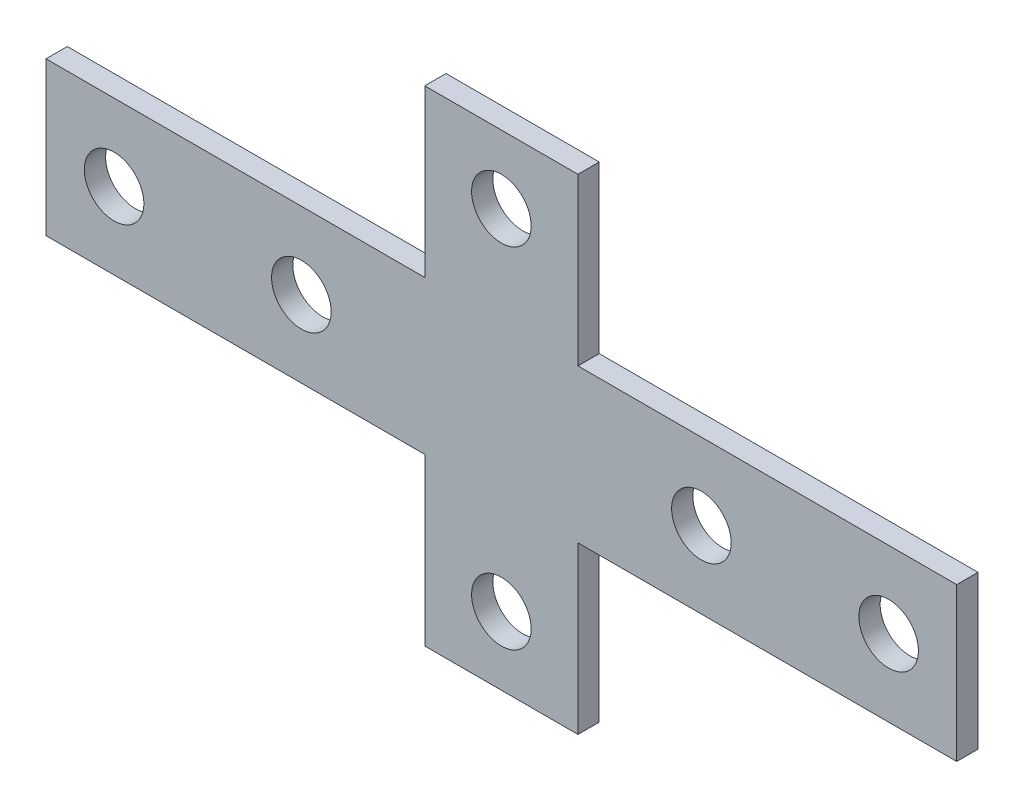
ISO-10303-21;
HEADER;
FILE_DESCRIPTION(('STEP AP214'),'2;1');
FILE_NAME('part.step','',(''),(''),'','','');
FILE_SCHEMA(('AUTOMOTIVE_DESIGN { 1 0 10303 214 1 1 1 1 }'));
ENDSEC;
DATA;
#1=APPLICATION_CONTEXT('core data for automotive mechanical design processes');
#2=APPLICATION_PROTOCOL_DEFINITION('international standard','automotive_design',2000,#1);
#3=PRODUCT_CONTEXT('',#1,'mechanical');
#4=PRODUCT('Part','Part','',(#3));
#5=PRODUCT_RELATED_PRODUCT_CATEGORY('part','',(#4));
#6=PRODUCT_DEFINITION_FORMATION('','',#4);
#7=PRODUCT_DEFINITION_CONTEXT('part definition',#1,'design');
#8=PRODUCT_DEFINITION('design','',#6,#7);
#9=PRODUCT_DEFINITION_SHAPE('','',#8);
#10=(LENGTH_UNIT() NAMED_UNIT(*) SI_UNIT(.MILLI.,.METRE.));
#11=(NAMED_UNIT(*) PLANE_ANGLE_UNIT() SI_UNIT($,.RADIAN.));
#12=(NAMED_UNIT(*) SI_UNIT($,.STERADIAN.) SOLID_ANGLE_UNIT());
#13=UNCERTAINTY_MEASURE_WITH_UNIT(LENGTH_MEASURE(1.E-05),#10,'distance_accuracy_value','');
#14=(GEOMETRIC_REPRESENTATION_CONTEXT(3) GLOBAL_UNCERTAINTY_ASSIGNED_CONTEXT((#13)) GLOBAL_UNIT_ASSIGNED_CONTEXT((#10,
#11,#12)) REPRESENTATION_CONTEXT('',''));
#15=CARTESIAN_POINT('',(0.,0.,0.));
#16=DIRECTION('',(0.,0.,1.));
#17=DIRECTION('',(1.,0.,0.));
#18=AXIS2_PLACEMENT_3D('',#15,#16,#17);
#19=CARTESIAN_POINT('',(0.,0.,2.5));
#20=DIRECTION('',(0.,0.,1.));
#21=DIRECTION('',(1.,0.,0.));
#22=AXIS2_PLACEMENT_3D('',#19,#20,#21);
#23=PLANE('',#22);
#24=CARTESIAN_POINT('',(23.5,0.,2.5));
#25=DIRECTION('',(0.,0.,1.));
#26=DIRECTION('',(-1.,0.,0.));
#27=AXIS2_PLACEMENT_3D('',#24,#25,#26);
#28=CIRCLE('',#27,3.5);
#29=CARTESIAN_POINT('',(20.,0.,2.5));
#30=VERTEX_POINT('',#29);
#31=EDGE_CURVE('E300',#30,#30,#28,.T.);
#32=ORIENTED_EDGE('',*,*,#31,.F.);
#33=EDGE_LOOP('',(#32));
#34=FACE_BOUND('',#33,.T.);
#35=CARTESIAN_POINT('',(-45.5,0.,2.5));
#36=DIRECTION('',(0.,0.,1.));
#37=DIRECTION('',(1.,0.,0.));
#38=AXIS2_PLACEMENT_3D('',#35,#36,#37);
#39=CIRCLE('',#38,3.5);
#40=CARTESIAN_POINT('',(-42.,0.,2.5));
#41=VERTEX_POINT('',#40);
#42=EDGE_CURVE('E312',#41,#41,#39,.T.);
#43=ORIENTED_EDGE('',*,*,#42,.F.);
#44=EDGE_LOOP('',(#43));
#45=FACE_BOUND('',#44,.T.);
#46=CARTESIAN_POINT('',(0.,-20.5,2.5));
#47=DIRECTION('',(0.,0.,1.));
#48=DIRECTION('',(1.,0.,0.));
#49=AXIS2_PLACEMENT_3D('',#46,#47,#48);
#50=CIRCLE('',#49,3.5);
#51=CARTESIAN_POINT('',(3.50000000000001,-20.5,2.5));
#52=VERTEX_POINT('',#51);
#53=EDGE_CURVE('E159',#52,#52,#50,.T.);
#54=ORIENTED_EDGE('',*,*,#53,.F.);
#55=EDGE_LOOP('',(#54));
#56=FACE_BOUND('',#55,.T.);
#57=DIRECTION('',(0.,1.,0.));
#58=VECTOR('',#57,1.);
#59=CARTESIAN_POINT('',(53.5,9.,2.5));
#60=LINE('',#59,#58);
#61=CARTESIAN_POINT('',(53.5,-9.,2.5));
#62=VERTEX_POINT('',#61);
#63=CARTESIAN_POINT('',(53.5,9.,2.5));
#64=VERTEX_POINT('',#63);
#65=EDGE_CURVE('E178',#62,#64,#60,.T.);
#66=ORIENTED_EDGE('',*,*,#65,.T.);
#67=DIRECTION('',(-1.,0.,0.));
#68=VECTOR('',#67,1.);
#69=CARTESIAN_POINT('',(8.99999999999998,9.,2.5));
#70=LINE('',#69,#68);
#71=CARTESIAN_POINT('',(8.99999999999998,9.,2.5));
#72=VERTEX_POINT('',#71);
#73=EDGE_CURVE('E106',#64,#72,#70,.T.);
#74=ORIENTED_EDGE('',*,*,#73,.T.);
#75=DIRECTION('',(0.,1.,0.));
#76=VECTOR('',#75,1.);
#77=CARTESIAN_POINT('',(8.99999999999998,9.,2.5));
#78=LINE('',#77,#76);
#79=CARTESIAN_POINT('',(8.99999999999998,28.5,2.5));
#80=VERTEX_POINT('',#79);
#81=EDGE_CURVE('E205',#72,#80,#78,.T.);
#82=ORIENTED_EDGE('',*,*,#81,.T.);
#83=DIRECTION('',(-1.,0.,0.));
#84=VECTOR('',#83,1.);
#85=CARTESIAN_POINT('',(-9.00000000000002,28.5,2.5));
#86=LINE('',#85,#84);
#87=CARTESIAN_POINT('',(-9.00000000000002,28.5,2.5));
#88=VERTEX_POINT('',#87);
#89=EDGE_CURVE('E224',#80,#88,#86,.T.);
#90=ORIENTED_EDGE('',*,*,#89,.T.);
#91=DIRECTION('',(0.,-1.,0.));
#92=VECTOR('',#91,1.);
#93=CARTESIAN_POINT('',(-9.00000000000002,9.,2.5));
#94=LINE('',#93,#92);
#95=CARTESIAN_POINT('',(-9.00000000000002,9.,2.5));
#96=VERTEX_POINT('',#95);
#97=EDGE_CURVE('E221',#88,#96,#94,.T.);
#98=ORIENTED_EDGE('',*,*,#97,.T.);
#99=DIRECTION('',(-1.,0.,0.));
#100=VECTOR('',#99,1.);
#101=CARTESIAN_POINT('',(-53.5,9.,2.5));
#102=LINE('',#101,#100);
#103=CARTESIAN_POINT('',(-53.5,9.,2.5));
#104=VERTEX_POINT('',#103);
#105=EDGE_CURVE('E223',#96,#104,#102,.T.);
#106=ORIENTED_EDGE('',*,*,#105,.T.);
#107=DIRECTION('',(0.,-1.,0.));
#108=VECTOR('',#107,1.);
#109=CARTESIAN_POINT('',(-53.5,9.,2.5));
#110=LINE('',#109,#108);
#111=CARTESIAN_POINT('',(-53.5,-9.,2.5));
#112=VERTEX_POINT('',#111);
#113=EDGE_CURVE('E226',#104,#112,#110,.T.);
#114=ORIENTED_EDGE('',*,*,#113,.T.);
#115=DIRECTION('',(1.,0.,0.));
#116=VECTOR('',#115,1.);
#117=CARTESIAN_POINT('',(-53.5,-9.,2.5));
#118=LINE('',#117,#116);
#119=CARTESIAN_POINT('',(-9.00000000000002,-9.,2.5));
#120=VERTEX_POINT('',#119);
#121=EDGE_CURVE('E232',#112,#120,#118,.T.);
#122=ORIENTED_EDGE('',*,*,#121,.T.);
#123=DIRECTION('',(0.,-1.,0.));
#124=VECTOR('',#123,1.);
#125=CARTESIAN_POINT('',(-9.00000000000002,-28.5,2.5));
#126=LINE('',#125,#124);
#127=CARTESIAN_POINT('',(-9.00000000000002,-28.5,2.5));
#128=VERTEX_POINT('',#127);
#129=EDGE_CURVE('E137',#120,#128,#126,.T.);
#130=ORIENTED_EDGE('',*,*,#129,.T.);
#131=DIRECTION('',(1.,0.,0.));
#132=VECTOR('',#131,1.);
#133=CARTESIAN_POINT('',(-9.00000000000002,-28.5,2.5));
#134=LINE('',#133,#132);
#135=CARTESIAN_POINT('',(8.99999999999998,-28.5,2.5));
#136=VERTEX_POINT('',#135);
#137=EDGE_CURVE('E131',#128,#136,#134,.T.);
#138=ORIENTED_EDGE('',*,*,#137,.T.);
#139=DIRECTION('',(0.,1.,0.));
#140=VECTOR('',#139,1.);
#141=CARTESIAN_POINT('',(8.99999999999998,-28.5,2.5));
#142=LINE('',#141,#140);
#143=CARTESIAN_POINT('',(8.99999999999998,-9.,2.5));
#144=VERTEX_POINT('',#143);
#145=EDGE_CURVE('E135',#136,#144,#142,.T.);
#146=ORIENTED_EDGE('',*,*,#145,.T.);
#147=DIRECTION('',(1.,0.,0.));
#148=VECTOR('',#147,1.);
#149=CARTESIAN_POINT('',(8.99999999999998,-9.,2.5));
#150=LINE('',#149,#148);
#151=EDGE_CURVE('E51',#144,#62,#150,.T.);
#152=ORIENTED_EDGE('',*,*,#151,.T.);
#153=EDGE_LOOP('',(#66,#74,#82,#90,#98,#106,#114,#122,#130,#138,#146,#152));
#154=FACE_BOUND('',#153,.T.);
#155=CARTESIAN_POINT('',(0.,20.5,2.5));
#156=DIRECTION('',(0.,0.,1.));
#157=DIRECTION('',(1.,0.,0.));
#158=AXIS2_PLACEMENT_3D('',#155,#156,#157);
#159=CIRCLE('',#158,3.5);
#160=CARTESIAN_POINT('',(3.5,20.5,2.5));
#161=VERTEX_POINT('',#160);
#162=EDGE_CURVE('E318',#161,#161,#159,.T.);
#163=ORIENTED_EDGE('',*,*,#162,.F.);
#164=EDGE_LOOP('',(#163));
#165=FACE_BOUND('',#164,.T.);
#166=CARTESIAN_POINT('',(-23.5,0.,2.5));
#167=DIRECTION('',(0.,0.,1.));
#168=DIRECTION('',(1.,0.,0.));
#169=AXIS2_PLACEMENT_3D('',#166,#167,#168);
#170=CIRCLE('',#169,3.5);
#171=CARTESIAN_POINT('',(-20.,0.,2.5));
#172=VERTEX_POINT('',#171);
#173=EDGE_CURVE('E306',#172,#172,#170,.T.);
#174=ORIENTED_EDGE('',*,*,#173,.F.);
#175=EDGE_LOOP('',(#174));
#176=FACE_BOUND('',#175,.T.);
#177=CARTESIAN_POINT('',(45.5,0.,2.5));
#178=DIRECTION('',(0.,0.,1.));
#179=DIRECTION('',(-1.,0.,0.));
#180=AXIS2_PLACEMENT_3D('',#177,#178,#179);
#181=CIRCLE('',#180,3.5);
#182=CARTESIAN_POINT('',(42.,0.,2.5));
#183=VERTEX_POINT('',#182);
#184=EDGE_CURVE('E291',#183,#183,#181,.T.);
#185=ORIENTED_EDGE('',*,*,#184,.F.);
#186=EDGE_LOOP('',(#185));
#187=FACE_BOUND('',#186,.T.);
#188=ADVANCED_FACE('F34',(#34,#45,#56,#154,#165,#176,#187),#23,.T.);
#189=CARTESIAN_POINT('',(0.,0.,0.));
#190=DIRECTION('',(0.,0.,1.));
#191=DIRECTION('',(1.,0.,0.));
#192=AXIS2_PLACEMENT_3D('',#189,#190,#191);
#193=PLANE('',#192);
#194=DIRECTION('',(0.,1.,0.));
#195=VECTOR('',#194,1.);
#196=CARTESIAN_POINT('',(53.5,9.,0.));
#197=LINE('',#196,#195);
#198=CARTESIAN_POINT('',(53.5,-9.,0.));
#199=VERTEX_POINT('',#198);
#200=CARTESIAN_POINT('',(53.5,9.,0.));
#201=VERTEX_POINT('',#200);
#202=EDGE_CURVE('E155',#199,#201,#197,.T.);
#203=ORIENTED_EDGE('',*,*,#202,.F.);
#204=DIRECTION('',(1.,0.,0.));
#205=VECTOR('',#204,1.);
#206=CARTESIAN_POINT('',(8.99999999999998,-9.,0.));
#207=LINE('',#206,#205);
#208=CARTESIAN_POINT('',(8.99999999999998,-9.,0.));
#209=VERTEX_POINT('',#208);
#210=EDGE_CURVE('E98',#209,#199,#207,.T.);
#211=ORIENTED_EDGE('',*,*,#210,.F.);
#212=DIRECTION('',(0.,1.,0.));
#213=VECTOR('',#212,1.);
#214=CARTESIAN_POINT('',(8.99999999999998,-28.5,0.));
#215=LINE('',#214,#213);
#216=CARTESIAN_POINT('',(8.99999999999998,-28.5,0.));
#217=VERTEX_POINT('',#216);
#218=EDGE_CURVE('E92',#217,#209,#215,.T.);
#219=ORIENTED_EDGE('',*,*,#218,.F.);
#220=DIRECTION('',(1.,0.,0.));
#221=VECTOR('',#220,1.);
#222=CARTESIAN_POINT('',(-9.00000000000002,-28.5,0.));
#223=LINE('',#222,#221);
#224=CARTESIAN_POINT('',(-9.00000000000002,-28.5,0.));
#225=VERTEX_POINT('',#224);
#226=EDGE_CURVE('E145',#225,#217,#223,.T.);
#227=ORIENTED_EDGE('',*,*,#226,.F.);
#228=DIRECTION('',(0.,-1.,0.));
#229=VECTOR('',#228,1.);
#230=CARTESIAN_POINT('',(-9.00000000000002,-28.5,0.));
#231=LINE('',#230,#229);
#232=CARTESIAN_POINT('',(-9.00000000000002,-9.,0.));
#233=VERTEX_POINT('',#232);
#234=EDGE_CURVE('E173',#233,#225,#231,.T.);
#235=ORIENTED_EDGE('',*,*,#234,.F.);
#236=DIRECTION('',(1.,0.,0.));
#237=VECTOR('',#236,1.);
#238=CARTESIAN_POINT('',(-53.5,-9.,0.));
#239=LINE('',#238,#237);
#240=CARTESIAN_POINT('',(-53.5,-9.,0.));
#241=VERTEX_POINT('',#240);
#242=EDGE_CURVE('E171',#241,#233,#239,.T.);
#243=ORIENTED_EDGE('',*,*,#242,.F.);
#244=DIRECTION('',(0.,-1.,0.));
#245=VECTOR('',#244,1.);
#246=CARTESIAN_POINT('',(-53.5,9.,0.));
#247=LINE('',#246,#245);
#248=CARTESIAN_POINT('',(-53.5,9.,0.));
#249=VERTEX_POINT('',#248);
#250=EDGE_CURVE('E169',#249,#241,#247,.T.);
#251=ORIENTED_EDGE('',*,*,#250,.F.);
#252=DIRECTION('',(-1.,0.,0.));
#253=VECTOR('',#252,1.);
#254=CARTESIAN_POINT('',(-53.5,9.,0.));
#255=LINE('',#254,#253);
#256=CARTESIAN_POINT('',(-9.00000000000002,9.,0.));
#257=VERTEX_POINT('',#256);
#258=EDGE_CURVE('E167',#257,#249,#255,.T.);
#259=ORIENTED_EDGE('',*,*,#258,.F.);
#260=DIRECTION('',(0.,-1.,0.));
#261=VECTOR('',#260,1.);
#262=CARTESIAN_POINT('',(-9.00000000000002,9.,0.));
#263=LINE('',#262,#261);
#264=CARTESIAN_POINT('',(-9.00000000000002,28.5,0.));
#265=VERTEX_POINT('',#264);
#266=EDGE_CURVE('E165',#265,#257,#263,.T.);
#267=ORIENTED_EDGE('',*,*,#266,.F.);
#268=DIRECTION('',(-1.,0.,0.));
#269=VECTOR('',#268,1.);
#270=CARTESIAN_POINT('',(-9.00000000000002,28.5,0.));
#271=LINE('',#270,#269);
#272=CARTESIAN_POINT('',(8.99999999999998,28.5,0.));
#273=VERTEX_POINT('',#272);
#274=EDGE_CURVE('E163',#273,#265,#271,.T.);
#275=ORIENTED_EDGE('',*,*,#274,.F.);
#276=DIRECTION('',(0.,1.,0.));
#277=VECTOR('',#276,1.);
#278=CARTESIAN_POINT('',(8.99999999999998,9.,0.));
#279=LINE('',#278,#277);
#280=CARTESIAN_POINT('',(8.99999999999998,9.,0.));
#281=VERTEX_POINT('',#280);
#282=EDGE_CURVE('E161',#281,#273,#279,.T.);
#283=ORIENTED_EDGE('',*,*,#282,.F.);
#284=DIRECTION('',(-1.,0.,0.));
#285=VECTOR('',#284,1.);
#286=CARTESIAN_POINT('',(8.99999999999998,9.,0.));
#287=LINE('',#286,#285);
#288=EDGE_CURVE('E158',#201,#281,#287,.T.);
#289=ORIENTED_EDGE('',*,*,#288,.F.);
#290=EDGE_LOOP('',(#203,#211,#219,#227,#235,#243,#251,#259,#267,#275,#283,#289));
#291=FACE_BOUND('',#290,.T.);
#292=CARTESIAN_POINT('',(0.,-20.5,0.));
#293=DIRECTION('',(0.,0.,1.));
#294=DIRECTION('',(1.,0.,0.));
#295=AXIS2_PLACEMENT_3D('',#292,#293,#294);
#296=CIRCLE('',#295,3.5);
#297=CARTESIAN_POINT('',(3.50000000000001,-20.5,0.));
#298=VERTEX_POINT('',#297);
#299=EDGE_CURVE('E321',#298,#298,#296,.T.);
#300=ORIENTED_EDGE('',*,*,#299,.T.);
#301=EDGE_LOOP('',(#300));
#302=FACE_BOUND('',#301,.T.);
#303=CARTESIAN_POINT('',(0.,20.5,0.));
#304=DIRECTION('',(0.,0.,1.));
#305=DIRECTION('',(1.,0.,0.));
#306=AXIS2_PLACEMENT_3D('',#303,#304,#305);
#307=CIRCLE('',#306,3.5);
#308=CARTESIAN_POINT('',(3.5,20.5,0.));
#309=VERTEX_POINT('',#308);
#310=EDGE_CURVE('E315',#309,#309,#307,.T.);
#311=ORIENTED_EDGE('',*,*,#310,.T.);
#312=EDGE_LOOP('',(#311));
#313=FACE_BOUND('',#312,.T.);
#314=CARTESIAN_POINT('',(-45.5,0.,0.));
#315=DIRECTION('',(0.,0.,1.));
#316=DIRECTION('',(1.,0.,0.));
#317=AXIS2_PLACEMENT_3D('',#314,#315,#316);
#318=CIRCLE('',#317,3.5);
#319=CARTESIAN_POINT('',(-42.,0.,0.));
#320=VERTEX_POINT('',#319);
#321=EDGE_CURVE('E309',#320,#320,#318,.T.);
#322=ORIENTED_EDGE('',*,*,#321,.T.);
#323=EDGE_LOOP('',(#322));
#324=FACE_BOUND('',#323,.T.);
#325=CARTESIAN_POINT('',(-23.5,0.,0.));
#326=DIRECTION('',(0.,0.,1.));
#327=DIRECTION('',(1.,0.,0.));
#328=AXIS2_PLACEMENT_3D('',#325,#326,#327);
#329=CIRCLE('',#328,3.5);
#330=CARTESIAN_POINT('',(-20.,0.,0.));
#331=VERTEX_POINT('',#330);
#332=EDGE_CURVE('E303',#331,#331,#329,.T.);
#333=ORIENTED_EDGE('',*,*,#332,.T.);
#334=EDGE_LOOP('',(#333));
#335=FACE_BOUND('',#334,.T.);
#336=CARTESIAN_POINT('',(23.5,0.,0.));
#337=DIRECTION('',(0.,0.,1.));
#338=DIRECTION('',(-1.,0.,0.));
#339=AXIS2_PLACEMENT_3D('',#336,#337,#338);
#340=CIRCLE('',#339,3.5);
#341=CARTESIAN_POINT('',(20.,0.,0.));
#342=VERTEX_POINT('',#341);
#343=EDGE_CURVE('E297',#342,#342,#340,.T.);
#344=ORIENTED_EDGE('',*,*,#343,.T.);
#345=EDGE_LOOP('',(#344));
#346=FACE_BOUND('',#345,.T.);
#347=CARTESIAN_POINT('',(45.5,0.,0.));
#348=DIRECTION('',(0.,0.,1.));
#349=DIRECTION('',(-1.,0.,0.));
#350=AXIS2_PLACEMENT_3D('',#347,#348,#349);
#351=CIRCLE('',#350,3.5);
#352=CARTESIAN_POINT('',(42.,0.,0.));
#353=VERTEX_POINT('',#352);
#354=EDGE_CURVE('E294',#353,#353,#351,.T.);
#355=ORIENTED_EDGE('',*,*,#354,.T.);
#356=EDGE_LOOP('',(#355));
#357=FACE_BOUND('',#356,.T.);
#358=ADVANCED_FACE('F209',(#291,#302,#313,#324,#335,#346,#357),#193,.F.);
#359=CARTESIAN_POINT('',(53.5,9.,2.5));
#360=DIRECTION('',(-1.,0.,0.));
#361=DIRECTION('',(0.,-1.,0.));
#362=AXIS2_PLACEMENT_3D('',#359,#360,#361);
#363=PLANE('',#362);
#364=ORIENTED_EDGE('',*,*,#202,.T.);
#365=DIRECTION('',(0.,0.,-1.));
#366=VECTOR('',#365,1.);
#367=CARTESIAN_POINT('',(53.5,9.,2.5));
#368=LINE('',#367,#366);
#369=EDGE_CURVE('E11',#64,#201,#368,.T.);
#370=ORIENTED_EDGE('',*,*,#369,.F.);
#371=ORIENTED_EDGE('',*,*,#65,.F.);
#372=DIRECTION('',(0.,0.,-1.));
#373=VECTOR('',#372,1.);
#374=CARTESIAN_POINT('',(53.5,-9.,2.5));
#375=LINE('',#374,#373);
#376=EDGE_CURVE('E151',#62,#199,#375,.T.);
#377=ORIENTED_EDGE('',*,*,#376,.T.);
#378=EDGE_LOOP('',(#364,#370,#371,#377));
#379=FACE_BOUND('',#378,.T.);
#380=ADVANCED_FACE('F36',(#379),#363,.F.);
#381=CARTESIAN_POINT('',(8.99999999999998,9.,2.5));
#382=DIRECTION('',(0.,-1.,0.));
#383=DIRECTION('',(0.,0.,-1.));
#384=AXIS2_PLACEMENT_3D('',#381,#382,#383);
#385=PLANE('',#384);
#386=ORIENTED_EDGE('',*,*,#288,.T.);
#387=DIRECTION('',(0.,0.,-1.));
#388=VECTOR('',#387,1.);
#389=CARTESIAN_POINT('',(8.99999999999998,9.,2.5));
#390=LINE('',#389,#388);
#391=EDGE_CURVE('E43',#72,#281,#390,.T.);
#392=ORIENTED_EDGE('',*,*,#391,.F.);
#393=ORIENTED_EDGE('',*,*,#73,.F.);
#394=ORIENTED_EDGE('',*,*,#369,.T.);
#395=EDGE_LOOP('',(#386,#392,#393,#394));
#396=FACE_BOUND('',#395,.T.);
#397=ADVANCED_FACE('F449',(#396),#385,.F.);
#398=CARTESIAN_POINT('',(8.99999999999998,9.,2.5));
#399=DIRECTION('',(-1.,0.,0.));
#400=DIRECTION('',(0.,0.,1.));
#401=AXIS2_PLACEMENT_3D('',#398,#399,#400);
#402=PLANE('',#401);
#403=ORIENTED_EDGE('',*,*,#282,.T.);
#404=DIRECTION('',(0.,0.,-1.));
#405=VECTOR('',#404,1.);
#406=CARTESIAN_POINT('',(8.99999999999998,28.5,2.5));
#407=LINE('',#406,#405);
#408=EDGE_CURVE('E197',#80,#273,#407,.T.);
#409=ORIENTED_EDGE('',*,*,#408,.F.);
#410=ORIENTED_EDGE('',*,*,#81,.F.);
#411=ORIENTED_EDGE('',*,*,#391,.T.);
#412=EDGE_LOOP('',(#403,#409,#410,#411));
#413=FACE_BOUND('',#412,.T.);
#414=ADVANCED_FACE('F203',(#413),#402,.F.);
#415=CARTESIAN_POINT('',(-9.00000000000002,28.5,2.5));
#416=DIRECTION('',(0.,-1.,0.));
#417=DIRECTION('',(0.,0.,-1.));
#418=AXIS2_PLACEMENT_3D('',#415,#416,#417);
#419=PLANE('',#418);
#420=ORIENTED_EDGE('',*,*,#274,.T.);
#421=DIRECTION('',(0.,0.,-1.));
#422=VECTOR('',#421,1.);
#423=CARTESIAN_POINT('',(-9.00000000000002,28.5,2.5));
#424=LINE('',#423,#422);
#425=EDGE_CURVE('E194',#88,#265,#424,.T.);
#426=ORIENTED_EDGE('',*,*,#425,.F.);
#427=ORIENTED_EDGE('',*,*,#89,.F.);
#428=ORIENTED_EDGE('',*,*,#408,.T.);
#429=EDGE_LOOP('',(#420,#426,#427,#428));
#430=FACE_BOUND('',#429,.T.);
#431=ADVANCED_FACE('F215',(#430),#419,.F.);
#432=CARTESIAN_POINT('',(-9.00000000000002,9.,2.5));
#433=DIRECTION('',(1.,0.,0.));
#434=DIRECTION('',(0.,1.,0.));
#435=AXIS2_PLACEMENT_3D('',#432,#433,#434);
#436=PLANE('',#435);
#437=ORIENTED_EDGE('',*,*,#266,.T.);
#438=DIRECTION('',(0.,0.,-1.));
#439=VECTOR('',#438,1.);
#440=CARTESIAN_POINT('',(-9.00000000000002,9.,2.5));
#441=LINE('',#440,#439);
#442=EDGE_CURVE('E191',#96,#257,#441,.T.);
#443=ORIENTED_EDGE('',*,*,#442,.F.);
#444=ORIENTED_EDGE('',*,*,#97,.F.);
#445=ORIENTED_EDGE('',*,*,#425,.T.);
#446=EDGE_LOOP('',(#437,#443,#444,#445));
#447=FACE_BOUND('',#446,.T.);
#448=ADVANCED_FACE('F219',(#447),#436,.F.);
#449=CARTESIAN_POINT('',(-53.5,9.,2.5));
#450=DIRECTION('',(0.,-1.,0.));
#451=DIRECTION('',(0.,0.,-1.));
#452=AXIS2_PLACEMENT_3D('',#449,#450,#451);
#453=PLANE('',#452);
#454=ORIENTED_EDGE('',*,*,#258,.T.);
#455=DIRECTION('',(0.,0.,-1.));
#456=VECTOR('',#455,1.);
#457=CARTESIAN_POINT('',(-53.5,9.,2.5));
#458=LINE('',#457,#456);
#459=EDGE_CURVE('E188',#104,#249,#458,.T.);
#460=ORIENTED_EDGE('',*,*,#459,.F.);
#461=ORIENTED_EDGE('',*,*,#105,.F.);
#462=ORIENTED_EDGE('',*,*,#442,.T.);
#463=EDGE_LOOP('',(#454,#460,#461,#462));
#464=FACE_BOUND('',#463,.T.);
#465=ADVANCED_FACE('F414',(#464),#453,.F.);
#466=CARTESIAN_POINT('',(-53.5,9.,2.5));
#467=DIRECTION('',(1.,0.,0.));
#468=DIRECTION('',(0.,0.,-1.));
#469=AXIS2_PLACEMENT_3D('',#466,#467,#468);
#470=PLANE('',#469);
#471=ORIENTED_EDGE('',*,*,#250,.T.);
#472=DIRECTION('',(0.,0.,-1.));
#473=VECTOR('',#472,1.);
#474=CARTESIAN_POINT('',(-53.5,-9.,2.5));
#475=LINE('',#474,#473);
#476=EDGE_CURVE('E185',#112,#241,#475,.T.);
#477=ORIENTED_EDGE('',*,*,#476,.F.);
#478=ORIENTED_EDGE('',*,*,#113,.F.);
#479=ORIENTED_EDGE('',*,*,#459,.T.);
#480=EDGE_LOOP('',(#471,#477,#478,#479));
#481=FACE_BOUND('',#480,.T.);
#482=ADVANCED_FACE('F405',(#481),#470,.F.);
#483=CARTESIAN_POINT('',(-53.5,-9.,2.5));
#484=DIRECTION('',(0.,1.,0.));
#485=DIRECTION('',(0.,0.,1.));
#486=AXIS2_PLACEMENT_3D('',#483,#484,#485);
#487=PLANE('',#486);
#488=ORIENTED_EDGE('',*,*,#242,.T.);
#489=DIRECTION('',(0.,0.,-1.));
#490=VECTOR('',#489,1.);
#491=CARTESIAN_POINT('',(-9.00000000000002,-9.,2.5));
#492=LINE('',#491,#490);
#493=EDGE_CURVE('E182',#120,#233,#492,.T.);
#494=ORIENTED_EDGE('',*,*,#493,.F.);
#495=ORIENTED_EDGE('',*,*,#121,.F.);
#496=ORIENTED_EDGE('',*,*,#476,.T.);
#497=EDGE_LOOP('',(#488,#494,#495,#496));
#498=FACE_BOUND('',#497,.T.);
#499=ADVANCED_FACE('F238',(#498),#487,.F.);
#500=CARTESIAN_POINT('',(-9.00000000000002,-28.5,2.5));
#501=DIRECTION('',(1.,0.,0.));
#502=DIRECTION('',(0.,1.,0.));
#503=AXIS2_PLACEMENT_3D('',#500,#501,#502);
#504=PLANE('',#503);
#505=ORIENTED_EDGE('',*,*,#234,.T.);
#506=DIRECTION('',(0.,0.,-1.));
#507=VECTOR('',#506,1.);
#508=CARTESIAN_POINT('',(-9.00000000000002,-28.5,2.5));
#509=LINE('',#508,#507);
#510=EDGE_CURVE('E146',#128,#225,#509,.T.);
#511=ORIENTED_EDGE('',*,*,#510,.F.);
#512=ORIENTED_EDGE('',*,*,#129,.F.);
#513=ORIENTED_EDGE('',*,*,#493,.T.);
#514=EDGE_LOOP('',(#505,#511,#512,#513));
#515=FACE_BOUND('',#514,.T.);
#516=ADVANCED_FACE('F242',(#515),#504,.F.);
#517=CARTESIAN_POINT('',(-9.00000000000002,-28.5,2.5));
#518=DIRECTION('',(0.,1.,0.));
#519=DIRECTION('',(0.,0.,1.));
#520=AXIS2_PLACEMENT_3D('',#517,#518,#519);
#521=PLANE('',#520);
#522=ORIENTED_EDGE('',*,*,#226,.T.);
#523=DIRECTION('',(0.,0.,-1.));
#524=VECTOR('',#523,1.);
#525=CARTESIAN_POINT('',(8.99999999999998,-28.5,2.5));
#526=LINE('',#525,#524);
#527=EDGE_CURVE('E142',#136,#217,#526,.T.);
#528=ORIENTED_EDGE('',*,*,#527,.F.);
#529=ORIENTED_EDGE('',*,*,#137,.F.);
#530=ORIENTED_EDGE('',*,*,#510,.T.);
#531=EDGE_LOOP('',(#522,#528,#529,#530));
#532=FACE_BOUND('',#531,.T.);
#533=ADVANCED_FACE('F143',(#532),#521,.F.);
#534=CARTESIAN_POINT('',(8.99999999999998,-28.5,2.5));
#535=DIRECTION('',(-1.,0.,0.));
#536=DIRECTION('',(0.,0.,1.));
#537=AXIS2_PLACEMENT_3D('',#534,#535,#536);
#538=PLANE('',#537);
#539=ORIENTED_EDGE('',*,*,#218,.T.);
#540=DIRECTION('',(0.,0.,-1.));
#541=VECTOR('',#540,1.);
#542=CARTESIAN_POINT('',(8.99999999999998,-9.,2.5));
#543=LINE('',#542,#541);
#544=EDGE_CURVE('E147',#144,#209,#543,.T.);
#545=ORIENTED_EDGE('',*,*,#544,.F.);
#546=ORIENTED_EDGE('',*,*,#145,.F.);
#547=ORIENTED_EDGE('',*,*,#527,.T.);
#548=EDGE_LOOP('',(#539,#545,#546,#547));
#549=FACE_BOUND('',#548,.T.);
#550=ADVANCED_FACE('F149',(#549),#538,.F.);
#551=CARTESIAN_POINT('',(8.99999999999998,-9.,2.5));
#552=DIRECTION('',(0.,1.,0.));
#553=DIRECTION('',(0.,0.,1.));
#554=AXIS2_PLACEMENT_3D('',#551,#552,#553);
#555=PLANE('',#554);
#556=ORIENTED_EDGE('',*,*,#210,.T.);
#557=ORIENTED_EDGE('',*,*,#376,.F.);
#558=ORIENTED_EDGE('',*,*,#151,.F.);
#559=ORIENTED_EDGE('',*,*,#544,.T.);
#560=EDGE_LOOP('',(#556,#557,#558,#559));
#561=FACE_BOUND('',#560,.T.);
#562=ADVANCED_FACE('F246',(#561),#555,.F.);
#563=CARTESIAN_POINT('',(0.,-20.5,2.5));
#564=DIRECTION('',(0.,0.,-1.));
#565=DIRECTION('',(-1.,0.,0.));
#566=AXIS2_PLACEMENT_3D('',#563,#564,#565);
#567=CYLINDRICAL_SURFACE('',#566,3.5);
#568=ORIENTED_EDGE('',*,*,#53,.T.);
#569=EDGE_LOOP('',(#568));
#570=FACE_BOUND('',#569,.T.);
#571=ORIENTED_EDGE('',*,*,#299,.F.);
#572=EDGE_LOOP('',(#571));
#573=FACE_BOUND('',#572,.T.);
#574=ADVANCED_FACE('F248',(#570,#573),#567,.F.);
#575=CARTESIAN_POINT('',(0.,20.5,2.5));
#576=DIRECTION('',(0.,0.,-1.));
#577=DIRECTION('',(-1.,0.,0.));
#578=AXIS2_PLACEMENT_3D('',#575,#576,#577);
#579=CYLINDRICAL_SURFACE('',#578,3.5);
#580=ORIENTED_EDGE('',*,*,#162,.T.);
#581=EDGE_LOOP('',(#580));
#582=FACE_BOUND('',#581,.T.);
#583=ORIENTED_EDGE('',*,*,#310,.F.);
#584=EDGE_LOOP('',(#583));
#585=FACE_BOUND('',#584,.T.);
#586=ADVANCED_FACE('F254',(#582,#585),#579,.F.);
#587=CARTESIAN_POINT('',(-45.5,0.,2.5));
#588=DIRECTION('',(0.,0.,-1.));
#589=DIRECTION('',(-1.,0.,0.));
#590=AXIS2_PLACEMENT_3D('',#587,#588,#589);
#591=CYLINDRICAL_SURFACE('',#590,3.5);
#592=ORIENTED_EDGE('',*,*,#42,.T.);
#593=EDGE_LOOP('',(#592));
#594=FACE_BOUND('',#593,.T.);
#595=ORIENTED_EDGE('',*,*,#321,.F.);
#596=EDGE_LOOP('',(#595));
#597=FACE_BOUND('',#596,.T.);
#598=ADVANCED_FACE('F270',(#594,#597),#591,.F.);
#599=CARTESIAN_POINT('',(-23.5,0.,2.5));
#600=DIRECTION('',(0.,0.,-1.));
#601=DIRECTION('',(-1.,0.,0.));
#602=AXIS2_PLACEMENT_3D('',#599,#600,#601);
#603=CYLINDRICAL_SURFACE('',#602,3.5);
#604=ORIENTED_EDGE('',*,*,#173,.T.);
#605=EDGE_LOOP('',(#604));
#606=FACE_BOUND('',#605,.T.);
#607=ORIENTED_EDGE('',*,*,#332,.F.);
#608=EDGE_LOOP('',(#607));
#609=FACE_BOUND('',#608,.T.);
#610=ADVANCED_FACE('F274',(#606,#609),#603,.F.);
#611=CARTESIAN_POINT('',(23.5,0.,2.5));
#612=DIRECTION('',(0.,0.,-1.));
#613=DIRECTION('',(-1.,0.,0.));
#614=AXIS2_PLACEMENT_3D('',#611,#612,#613);
#615=CYLINDRICAL_SURFACE('',#614,3.5);
#616=ORIENTED_EDGE('',*,*,#31,.T.);
#617=EDGE_LOOP('',(#616));
#618=FACE_BOUND('',#617,.T.);
#619=ORIENTED_EDGE('',*,*,#343,.F.);
#620=EDGE_LOOP('',(#619));
#621=FACE_BOUND('',#620,.T.);
#622=ADVANCED_FACE('F278',(#618,#621),#615,.F.);
#623=CARTESIAN_POINT('',(45.5,0.,2.5));
#624=DIRECTION('',(0.,0.,-1.));
#625=DIRECTION('',(-1.,0.,0.));
#626=AXIS2_PLACEMENT_3D('',#623,#624,#625);
#627=CYLINDRICAL_SURFACE('',#626,3.5);
#628=ORIENTED_EDGE('',*,*,#184,.T.);
#629=EDGE_LOOP('',(#628));
#630=FACE_BOUND('',#629,.T.);
#631=ORIENTED_EDGE('',*,*,#354,.F.);
#632=EDGE_LOOP('',(#631));
#633=FACE_BOUND('',#632,.T.);
#634=ADVANCED_FACE('F282',(#630,#633),#627,.F.);
#635=CLOSED_SHELL('',(#188,#358,#380,#397,#414,#431,#448,#465,#482,#499,#516,#533,#550,#562,
#574,#586,#598,#610,#622,#634));
#636=MANIFOLD_SOLID_BREP('B2',#635);
#637=ADVANCED_BREP_SHAPE_REPRESENTATION('',(#18,#636),#14);
#638=SHAPE_DEFINITION_REPRESENTATION(#9,#637);
ENDSEC;
END-ISO-10303-21;
